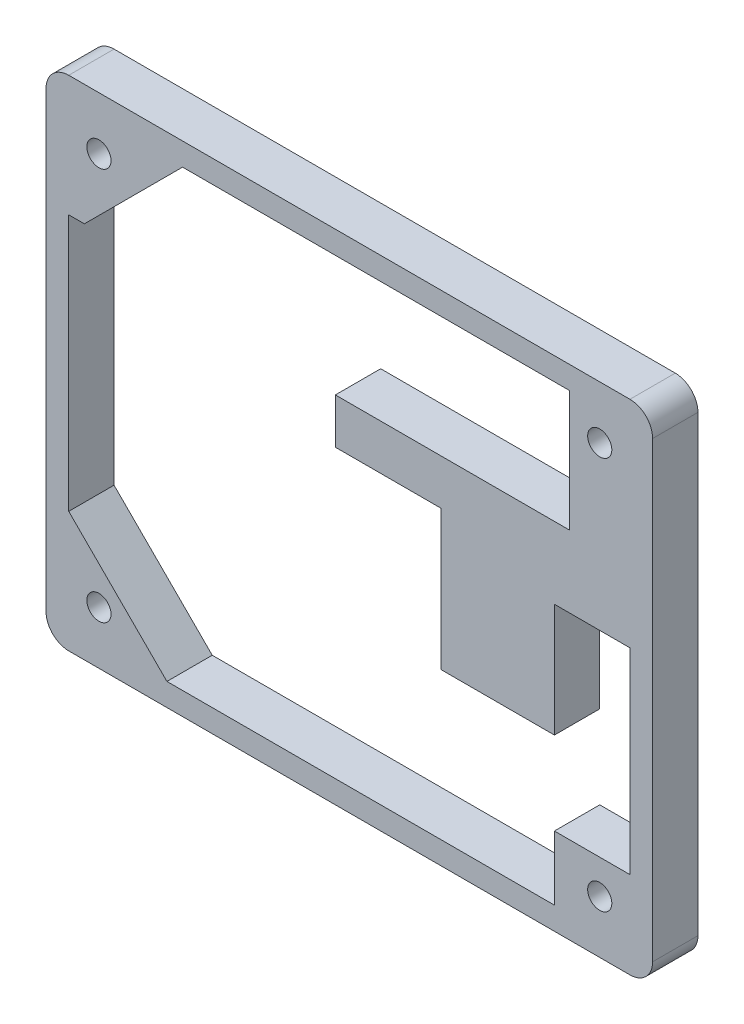
ISO-10303-21;
HEADER;
FILE_DESCRIPTION(('STEP AP214'),'2;1');
FILE_NAME('part.step','',(''),(''),'','','');
FILE_SCHEMA(('AUTOMOTIVE_DESIGN { 1 0 10303 214 1 1 1 1 }'));
ENDSEC;
DATA;
#1=APPLICATION_CONTEXT('core data for automotive mechanical design processes');
#2=APPLICATION_PROTOCOL_DEFINITION('international standard','automotive_design',2000,#1);
#3=PRODUCT_CONTEXT('',#1,'mechanical');
#4=PRODUCT('Part','Part','',(#3));
#5=PRODUCT_RELATED_PRODUCT_CATEGORY('part','',(#4));
#6=PRODUCT_DEFINITION_FORMATION('','',#4);
#7=PRODUCT_DEFINITION_CONTEXT('part definition',#1,'design');
#8=PRODUCT_DEFINITION('design','',#6,#7);
#9=PRODUCT_DEFINITION_SHAPE('','',#8);
#10=(LENGTH_UNIT() NAMED_UNIT(*) SI_UNIT(.MILLI.,.METRE.));
#11=(NAMED_UNIT(*) PLANE_ANGLE_UNIT() SI_UNIT($,.RADIAN.));
#12=(NAMED_UNIT(*) SI_UNIT($,.STERADIAN.) SOLID_ANGLE_UNIT());
#13=UNCERTAINTY_MEASURE_WITH_UNIT(LENGTH_MEASURE(1.E-05),#10,'distance_accuracy_value','');
#14=(GEOMETRIC_REPRESENTATION_CONTEXT(3) GLOBAL_UNCERTAINTY_ASSIGNED_CONTEXT((#13)) GLOBAL_UNIT_ASSIGNED_CONTEXT((#10,
#11,#12)) REPRESENTATION_CONTEXT('',''));
#15=CARTESIAN_POINT('',(0.,0.,0.));
#16=DIRECTION('',(0.,0.,1.));
#17=DIRECTION('',(1.,0.,0.));
#18=AXIS2_PLACEMENT_3D('',#15,#16,#17);
#19=CARTESIAN_POINT('',(0.,0.,6.));
#20=DIRECTION('',(1.,0.,0.));
#21=DIRECTION('',(0.,0.,-1.));
#22=AXIS2_PLACEMENT_3D('',#19,#20,#21);
#23=PLANE('',#22);
#24=DIRECTION('',(0.,-1.,0.));
#25=VECTOR('',#24,1.);
#26=CARTESIAN_POINT('',(0.,0.,0.));
#27=LINE('',#26,#25);
#28=CARTESIAN_POINT('',(0.,63.,0.));
#29=VERTEX_POINT('',#28);
#30=CARTESIAN_POINT('',(0.,3.,0.));
#31=VERTEX_POINT('',#30);
#32=EDGE_CURVE('E323',#29,#31,#27,.T.);
#33=ORIENTED_EDGE('',*,*,#32,.T.);
#34=DIRECTION('',(0.,0.,-1.));
#35=VECTOR('',#34,1.);
#36=CARTESIAN_POINT('',(0.,3.,6.));
#37=LINE('',#36,#35);
#38=CARTESIAN_POINT('',(0.,3.,6.));
#39=VERTEX_POINT('',#38);
#40=EDGE_CURVE('E11',#31,#39,#37,.F.);
#41=ORIENTED_EDGE('',*,*,#40,.T.);
#42=DIRECTION('',(0.,-1.,0.));
#43=VECTOR('',#42,1.);
#44=CARTESIAN_POINT('',(0.,0.,6.));
#45=LINE('',#44,#43);
#46=CARTESIAN_POINT('',(0.,63.,6.));
#47=VERTEX_POINT('',#46);
#48=EDGE_CURVE('E324',#47,#39,#45,.T.);
#49=ORIENTED_EDGE('',*,*,#48,.F.);
#50=DIRECTION('',(0.,0.,-1.));
#51=VECTOR('',#50,1.);
#52=CARTESIAN_POINT('',(0.,63.,6.));
#53=LINE('',#52,#51);
#54=EDGE_CURVE('E41',#47,#29,#53,.T.);
#55=ORIENTED_EDGE('',*,*,#54,.T.);
#56=EDGE_LOOP('',(#33,#41,#49,#55));
#57=FACE_BOUND('',#56,.T.);
#58=ADVANCED_FACE('F33',(#57),#23,.F.);
#59=CARTESIAN_POINT('',(0.,0.,6.));
#60=DIRECTION('',(0.,1.,0.));
#61=DIRECTION('',(0.,0.,1.));
#62=AXIS2_PLACEMENT_3D('',#59,#60,#61);
#63=PLANE('',#62);
#64=DIRECTION('',(1.,0.,0.));
#65=VECTOR('',#64,1.);
#66=CARTESIAN_POINT('',(0.,0.,0.));
#67=LINE('',#66,#65);
#68=CARTESIAN_POINT('',(3.,0.,0.));
#69=VERTEX_POINT('',#68);
#70=CARTESIAN_POINT('',(77.3,0.,0.));
#71=VERTEX_POINT('',#70);
#72=EDGE_CURVE('E340',#69,#71,#67,.T.);
#73=ORIENTED_EDGE('',*,*,#72,.T.);
#74=DIRECTION('',(0.,0.,-1.));
#75=VECTOR('',#74,1.);
#76=CARTESIAN_POINT('',(77.3,0.,6.));
#77=LINE('',#76,#75);
#78=CARTESIAN_POINT('',(77.3,0.,6.));
#79=VERTEX_POINT('',#78);
#80=EDGE_CURVE('E376',#71,#79,#77,.F.);
#81=ORIENTED_EDGE('',*,*,#80,.T.);
#82=DIRECTION('',(1.,0.,0.));
#83=VECTOR('',#82,1.);
#84=CARTESIAN_POINT('',(0.,0.,6.));
#85=LINE('',#84,#83);
#86=CARTESIAN_POINT('',(3.,0.,6.));
#87=VERTEX_POINT('',#86);
#88=EDGE_CURVE('E327',#87,#79,#85,.T.);
#89=ORIENTED_EDGE('',*,*,#88,.F.);
#90=DIRECTION('',(0.,0.,-1.));
#91=VECTOR('',#90,1.);
#92=CARTESIAN_POINT('',(3.,0.,6.));
#93=LINE('',#92,#91);
#94=EDGE_CURVE('E373',#87,#69,#93,.T.);
#95=ORIENTED_EDGE('',*,*,#94,.T.);
#96=EDGE_LOOP('',(#73,#81,#89,#95));
#97=FACE_BOUND('',#96,.T.);
#98=ADVANCED_FACE('F394',(#97),#63,.F.);
#99=CARTESIAN_POINT('',(80.3,0.,6.));
#100=DIRECTION('',(-1.,0.,0.));
#101=DIRECTION('',(0.,0.,1.));
#102=AXIS2_PLACEMENT_3D('',#99,#100,#101);
#103=PLANE('',#102);
#104=DIRECTION('',(0.,1.,0.));
#105=VECTOR('',#104,1.);
#106=CARTESIAN_POINT('',(80.3,0.,0.));
#107=LINE('',#106,#105);
#108=CARTESIAN_POINT('',(80.3,3.,0.));
#109=VERTEX_POINT('',#108);
#110=CARTESIAN_POINT('',(80.3,63.,0.));
#111=VERTEX_POINT('',#110);
#112=EDGE_CURVE('E343',#109,#111,#107,.T.);
#113=ORIENTED_EDGE('',*,*,#112,.T.);
#114=DIRECTION('',(0.,0.,-1.));
#115=VECTOR('',#114,1.);
#116=CARTESIAN_POINT('',(80.3,63.,6.));
#117=LINE('',#116,#115);
#118=CARTESIAN_POINT('',(80.3,63.,6.));
#119=VERTEX_POINT('',#118);
#120=EDGE_CURVE('E363',#111,#119,#117,.F.);
#121=ORIENTED_EDGE('',*,*,#120,.T.);
#122=DIRECTION('',(0.,1.,0.));
#123=VECTOR('',#122,1.);
#124=CARTESIAN_POINT('',(80.3,0.,6.));
#125=LINE('',#124,#123);
#126=CARTESIAN_POINT('',(80.3,3.,6.));
#127=VERTEX_POINT('',#126);
#128=EDGE_CURVE('E331',#127,#119,#125,.T.);
#129=ORIENTED_EDGE('',*,*,#128,.F.);
#130=DIRECTION('',(0.,0.,-1.));
#131=VECTOR('',#130,1.);
#132=CARTESIAN_POINT('',(80.3,3.,6.));
#133=LINE('',#132,#131);
#134=EDGE_CURVE('E360',#127,#109,#133,.T.);
#135=ORIENTED_EDGE('',*,*,#134,.T.);
#136=EDGE_LOOP('',(#113,#121,#129,#135));
#137=FACE_BOUND('',#136,.T.);
#138=ADVANCED_FACE('F405',(#137),#103,.F.);
#139=CARTESIAN_POINT('',(0.,66.,6.));
#140=DIRECTION('',(0.,-1.,0.));
#141=DIRECTION('',(0.,0.,-1.));
#142=AXIS2_PLACEMENT_3D('',#139,#140,#141);
#143=PLANE('',#142);
#144=DIRECTION('',(-1.,0.,0.));
#145=VECTOR('',#144,1.);
#146=CARTESIAN_POINT('',(0.,66.,6.));
#147=LINE('',#146,#145);
#148=CARTESIAN_POINT('',(77.3,66.,6.));
#149=VERTEX_POINT('',#148);
#150=CARTESIAN_POINT('',(3.,66.,6.));
#151=VERTEX_POINT('',#150);
#152=EDGE_CURVE('E334',#149,#151,#147,.T.);
#153=ORIENTED_EDGE('',*,*,#152,.F.);
#154=DIRECTION('',(0.,0.,-1.));
#155=VECTOR('',#154,1.);
#156=CARTESIAN_POINT('',(77.3,66.,6.));
#157=LINE('',#156,#155);
#158=CARTESIAN_POINT('',(77.3,66.,0.));
#159=VERTEX_POINT('',#158);
#160=EDGE_CURVE('E349',#149,#159,#157,.T.);
#161=ORIENTED_EDGE('',*,*,#160,.T.);
#162=DIRECTION('',(-1.,0.,0.));
#163=VECTOR('',#162,1.);
#164=CARTESIAN_POINT('',(0.,66.,0.));
#165=LINE('',#164,#163);
#166=CARTESIAN_POINT('',(3.,66.,0.));
#167=VERTEX_POINT('',#166);
#168=EDGE_CURVE('E328',#159,#167,#165,.T.);
#169=ORIENTED_EDGE('',*,*,#168,.T.);
#170=DIRECTION('',(0.,0.,-1.));
#171=VECTOR('',#170,1.);
#172=CARTESIAN_POINT('',(3.,66.,6.));
#173=LINE('',#172,#171);
#174=EDGE_CURVE('E337',#167,#151,#173,.F.);
#175=ORIENTED_EDGE('',*,*,#174,.T.);
#176=EDGE_LOOP('',(#153,#161,#169,#175));
#177=FACE_BOUND('',#176,.T.);
#178=ADVANCED_FACE('F413',(#177),#143,.F.);
#179=CARTESIAN_POINT('',(0.,0.,6.));
#180=DIRECTION('',(0.,0.,-1.));
#181=DIRECTION('',(-1.,0.,0.));
#182=AXIS2_PLACEMENT_3D('',#179,#180,#181);
#183=PLANE('',#182);
#184=DIRECTION('',(1.,0.,0.));
#185=VECTOR('',#184,1.);
#186=CARTESIAN_POINT('',(77.3,11.5,6.));
#187=LINE('',#186,#185);
#188=CARTESIAN_POINT('',(67.3,11.5,6.));
#189=VERTEX_POINT('',#188);
#190=CARTESIAN_POINT('',(77.3,11.5,6.));
#191=VERTEX_POINT('',#190);
#192=EDGE_CURVE('E240',#189,#191,#187,.T.);
#193=ORIENTED_EDGE('',*,*,#192,.F.);
#194=DIRECTION('',(0.,1.,0.));
#195=VECTOR('',#194,1.);
#196=CARTESIAN_POINT('',(67.3,11.5,6.));
#197=LINE('',#196,#195);
#198=CARTESIAN_POINT('',(67.3,3.,6.));
#199=VERTEX_POINT('',#198);
#200=EDGE_CURVE('E761',#199,#189,#197,.T.);
#201=ORIENTED_EDGE('',*,*,#200,.F.);
#202=DIRECTION('',(1.,0.,0.));
#203=VECTOR('',#202,1.);
#204=CARTESIAN_POINT('',(25.8293559072506,3.,6.));
#205=LINE('',#204,#203);
#206=CARTESIAN_POINT('',(16.0000000000002,2.99999999999999,6.));
#207=VERTEX_POINT('',#206);
#208=EDGE_CURVE('E766',#207,#199,#205,.T.);
#209=ORIENTED_EDGE('',*,*,#208,.F.);
#210=DIRECTION('',(0.707106781186552,-0.707106781186543,0.));
#211=VECTOR('',#210,1.);
#212=CARTESIAN_POINT('',(16.0000000000002,2.99999999999999,6.));
#213=LINE('',#212,#211);
#214=CARTESIAN_POINT('',(3.,16.,6.));
#215=VERTEX_POINT('',#214);
#216=EDGE_CURVE('E735',#215,#207,#213,.T.);
#217=ORIENTED_EDGE('',*,*,#216,.F.);
#218=DIRECTION('',(0.,-1.,0.));
#219=VECTOR('',#218,1.);
#220=CARTESIAN_POINT('',(3.,16.,6.));
#221=LINE('',#220,#219);
#222=CARTESIAN_POINT('',(3.,50.,6.));
#223=VERTEX_POINT('',#222);
#224=EDGE_CURVE('E279',#223,#215,#221,.T.);
#225=ORIENTED_EDGE('',*,*,#224,.F.);
#226=DIRECTION('',(-1.,0.,0.));
#227=VECTOR('',#226,1.);
#228=CARTESIAN_POINT('',(3.,50.,6.));
#229=LINE('',#228,#227);
#230=CARTESIAN_POINT('',(5.07106781186543,50.,6.));
#231=VERTEX_POINT('',#230);
#232=EDGE_CURVE('E289',#231,#223,#229,.T.);
#233=ORIENTED_EDGE('',*,*,#232,.F.);
#234=DIRECTION('',(-0.707106781186551,-0.707106781186544,0.));
#235=VECTOR('',#234,1.);
#236=CARTESIAN_POINT('',(5.07106781186543,50.,6.));
#237=LINE('',#236,#235);
#238=CARTESIAN_POINT('',(18.0710678118656,63.,6.));
#239=VERTEX_POINT('',#238);
#240=EDGE_CURVE('E726',#239,#231,#237,.T.);
#241=ORIENTED_EDGE('',*,*,#240,.F.);
#242=DIRECTION('',(-1.,0.,0.));
#243=VECTOR('',#242,1.);
#244=CARTESIAN_POINT('',(69.3,63.,6.));
#245=LINE('',#244,#243);
#246=CARTESIAN_POINT('',(69.3,63.,6.));
#247=VERTEX_POINT('',#246);
#248=EDGE_CURVE('E273',#247,#239,#245,.T.);
#249=ORIENTED_EDGE('',*,*,#248,.F.);
#250=DIRECTION('',(0.,1.,0.));
#251=VECTOR('',#250,1.);
#252=CARTESIAN_POINT('',(69.3,63.,6.));
#253=LINE('',#252,#251);
#254=CARTESIAN_POINT('',(69.3,47.,6.));
#255=VERTEX_POINT('',#254);
#256=EDGE_CURVE('E261',#255,#247,#253,.T.);
#257=ORIENTED_EDGE('',*,*,#256,.F.);
#258=DIRECTION('',(1.,0.,0.));
#259=VECTOR('',#258,1.);
#260=CARTESIAN_POINT('',(69.3,47.,6.));
#261=LINE('',#260,#259);
#262=CARTESIAN_POINT('',(38.3,47.,6.));
#263=VERTEX_POINT('',#262);
#264=EDGE_CURVE('E266',#263,#255,#261,.T.);
#265=ORIENTED_EDGE('',*,*,#264,.F.);
#266=DIRECTION('',(0.,1.,0.));
#267=VECTOR('',#266,1.);
#268=CARTESIAN_POINT('',(38.3,47.,6.));
#269=LINE('',#268,#267);
#270=CARTESIAN_POINT('',(38.3,41.,6.));
#271=VERTEX_POINT('',#270);
#272=EDGE_CURVE('E736',#271,#263,#269,.T.);
#273=ORIENTED_EDGE('',*,*,#272,.F.);
#274=DIRECTION('',(-1.,0.,0.));
#275=VECTOR('',#274,1.);
#276=CARTESIAN_POINT('',(52.3,41.,6.));
#277=LINE('',#276,#275);
#278=CARTESIAN_POINT('',(52.3,41.,6.));
#279=VERTEX_POINT('',#278);
#280=EDGE_CURVE('E254',#279,#271,#277,.T.);
#281=ORIENTED_EDGE('',*,*,#280,.F.);
#282=DIRECTION('',(0.,1.,0.));
#283=VECTOR('',#282,1.);
#284=CARTESIAN_POINT('',(52.3,41.,6.));
#285=LINE('',#284,#283);
#286=CARTESIAN_POINT('',(52.3,22.5,6.));
#287=VERTEX_POINT('',#286);
#288=EDGE_CURVE('E245',#287,#279,#285,.T.);
#289=ORIENTED_EDGE('',*,*,#288,.F.);
#290=DIRECTION('',(-1.,0.,0.));
#291=VECTOR('',#290,1.);
#292=CARTESIAN_POINT('',(25.8293559072506,22.5,6.));
#293=LINE('',#292,#291);
#294=CARTESIAN_POINT('',(67.3,22.5,6.));
#295=VERTEX_POINT('',#294);
#296=EDGE_CURVE('E774',#295,#287,#293,.T.);
#297=ORIENTED_EDGE('',*,*,#296,.F.);
#298=DIRECTION('',(0.,-1.,0.));
#299=VECTOR('',#298,1.);
#300=CARTESIAN_POINT('',(67.3,37.5,6.));
#301=LINE('',#300,#299);
#302=CARTESIAN_POINT('',(67.3,37.5,6.));
#303=VERTEX_POINT('',#302);
#304=EDGE_CURVE('E216',#303,#295,#301,.T.);
#305=ORIENTED_EDGE('',*,*,#304,.F.);
#306=DIRECTION('',(-1.,0.,0.));
#307=VECTOR('',#306,1.);
#308=CARTESIAN_POINT('',(77.3,37.5,6.));
#309=LINE('',#308,#307);
#310=CARTESIAN_POINT('',(77.3,37.5,6.));
#311=VERTEX_POINT('',#310);
#312=EDGE_CURVE('E236',#311,#303,#309,.T.);
#313=ORIENTED_EDGE('',*,*,#312,.F.);
#314=DIRECTION('',(0.,1.,0.));
#315=VECTOR('',#314,1.);
#316=CARTESIAN_POINT('',(77.3,37.5,6.));
#317=LINE('',#316,#315);
#318=EDGE_CURVE('E56',#191,#311,#317,.T.);
#319=ORIENTED_EDGE('',*,*,#318,.F.);
#320=EDGE_LOOP('',(#193,#201,#209,#217,#225,#233,#241,#249,#257,#265,#273,#281,#289,#297,#305,
#313,#319));
#321=FACE_BOUND('',#320,.T.);
#322=CARTESIAN_POINT('',(7.,59.,6.));
#323=DIRECTION('',(0.,0.,1.));
#324=DIRECTION('',(1.,0.,0.));
#325=AXIS2_PLACEMENT_3D('',#322,#323,#324);
#326=CIRCLE('',#325,1.59999999999999);
#327=CARTESIAN_POINT('',(8.59999999999999,59.,6.));
#328=VERTEX_POINT('',#327);
#329=EDGE_CURVE('E298',#328,#328,#326,.T.);
#330=ORIENTED_EDGE('',*,*,#329,.F.);
#331=EDGE_LOOP('',(#330));
#332=FACE_BOUND('',#331,.T.);
#333=CARTESIAN_POINT('',(73.3,59.,6.));
#334=DIRECTION('',(0.,0.,1.));
#335=DIRECTION('',(1.,0.,0.));
#336=AXIS2_PLACEMENT_3D('',#333,#334,#335);
#337=CIRCLE('',#336,1.59999999999999);
#338=CARTESIAN_POINT('',(74.9,59.,6.));
#339=VERTEX_POINT('',#338);
#340=EDGE_CURVE('E305',#339,#339,#337,.T.);
#341=ORIENTED_EDGE('',*,*,#340,.F.);
#342=EDGE_LOOP('',(#341));
#343=FACE_BOUND('',#342,.T.);
#344=CARTESIAN_POINT('',(73.3,7.,6.));
#345=DIRECTION('',(0.,0.,1.));
#346=DIRECTION('',(1.,0.,0.));
#347=AXIS2_PLACEMENT_3D('',#344,#345,#346);
#348=CIRCLE('',#347,1.59999999999999);
#349=CARTESIAN_POINT('',(74.9,7.,6.));
#350=VERTEX_POINT('',#349);
#351=EDGE_CURVE('E311',#350,#350,#348,.T.);
#352=ORIENTED_EDGE('',*,*,#351,.F.);
#353=EDGE_LOOP('',(#352));
#354=FACE_BOUND('',#353,.T.);
#355=CARTESIAN_POINT('',(7.00000000000001,7.,6.));
#356=DIRECTION('',(0.,0.,1.));
#357=DIRECTION('',(1.,0.,0.));
#358=AXIS2_PLACEMENT_3D('',#355,#356,#357);
#359=CIRCLE('',#358,1.59999999999999);
#360=CARTESIAN_POINT('',(8.59999999999999,7.,6.));
#361=VERTEX_POINT('',#360);
#362=EDGE_CURVE('E317',#361,#361,#359,.T.);
#363=ORIENTED_EDGE('',*,*,#362,.F.);
#364=EDGE_LOOP('',(#363));
#365=FACE_BOUND('',#364,.T.);
#366=ORIENTED_EDGE('',*,*,#128,.T.);
#367=CARTESIAN_POINT('',(77.3,63.,6.));
#368=DIRECTION('',(0.,0.,-1.));
#369=DIRECTION('',(-1.,0.,0.));
#370=AXIS2_PLACEMENT_3D('',#367,#368,#369);
#371=CIRCLE('',#370,3.);
#372=EDGE_CURVE('E371',#119,#149,#371,.F.);
#373=ORIENTED_EDGE('',*,*,#372,.T.);
#374=ORIENTED_EDGE('',*,*,#152,.T.);
#375=CARTESIAN_POINT('',(3.,63.,6.));
#376=DIRECTION('',(0.,0.,-1.));
#377=DIRECTION('',(-1.,0.,0.));
#378=AXIS2_PLACEMENT_3D('',#375,#376,#377);
#379=CIRCLE('',#378,3.);
#380=EDGE_CURVE('E365',#151,#47,#379,.F.);
#381=ORIENTED_EDGE('',*,*,#380,.T.);
#382=ORIENTED_EDGE('',*,*,#48,.T.);
#383=CARTESIAN_POINT('',(3.,3.,6.));
#384=DIRECTION('',(0.,0.,-1.));
#385=DIRECTION('',(-1.,0.,0.));
#386=AXIS2_PLACEMENT_3D('',#383,#384,#385);
#387=CIRCLE('',#386,3.);
#388=EDGE_CURVE('E367',#39,#87,#387,.F.);
#389=ORIENTED_EDGE('',*,*,#388,.T.);
#390=ORIENTED_EDGE('',*,*,#88,.T.);
#391=CARTESIAN_POINT('',(77.3,3.,6.));
#392=DIRECTION('',(0.,0.,-1.));
#393=DIRECTION('',(-1.,0.,0.));
#394=AXIS2_PLACEMENT_3D('',#391,#392,#393);
#395=CIRCLE('',#394,3.);
#396=EDGE_CURVE('E369',#79,#127,#395,.F.);
#397=ORIENTED_EDGE('',*,*,#396,.T.);
#398=EDGE_LOOP('',(#366,#373,#374,#381,#382,#389,#390,#397));
#399=FACE_BOUND('',#398,.T.);
#400=ADVANCED_FACE('F398',(#321,#332,#343,#354,#365,#399),#183,.F.);
#401=CARTESIAN_POINT('',(0.,0.,0.));
#402=DIRECTION('',(0.,0.,-1.));
#403=DIRECTION('',(-1.,0.,0.));
#404=AXIS2_PLACEMENT_3D('',#401,#402,#403);
#405=PLANE('',#404);
#406=DIRECTION('',(0.,1.,0.));
#407=VECTOR('',#406,1.);
#408=CARTESIAN_POINT('',(67.3,22.5,0.));
#409=LINE('',#408,#407);
#410=CARTESIAN_POINT('',(67.3,3.,0.));
#411=VERTEX_POINT('',#410);
#412=CARTESIAN_POINT('',(67.3,11.5,0.));
#413=VERTEX_POINT('',#412);
#414=EDGE_CURVE('E755',#411,#413,#409,.T.);
#415=ORIENTED_EDGE('',*,*,#414,.T.);
#416=DIRECTION('',(1.,0.,0.));
#417=VECTOR('',#416,1.);
#418=CARTESIAN_POINT('',(77.3,11.5,0.));
#419=LINE('',#418,#417);
#420=CARTESIAN_POINT('',(77.3,11.5,0.));
#421=VERTEX_POINT('',#420);
#422=EDGE_CURVE('E226',#413,#421,#419,.T.);
#423=ORIENTED_EDGE('',*,*,#422,.T.);
#424=DIRECTION('',(0.,1.,0.));
#425=VECTOR('',#424,1.);
#426=CARTESIAN_POINT('',(77.3,37.5,0.));
#427=LINE('',#426,#425);
#428=CARTESIAN_POINT('',(77.3,37.5,0.));
#429=VERTEX_POINT('',#428);
#430=EDGE_CURVE('E231',#421,#429,#427,.T.);
#431=ORIENTED_EDGE('',*,*,#430,.T.);
#432=DIRECTION('',(-1.,0.,0.));
#433=VECTOR('',#432,1.);
#434=CARTESIAN_POINT('',(77.3,37.5,0.));
#435=LINE('',#434,#433);
#436=CARTESIAN_POINT('',(67.3,37.5,0.));
#437=VERTEX_POINT('',#436);
#438=EDGE_CURVE('E225',#429,#437,#435,.T.);
#439=ORIENTED_EDGE('',*,*,#438,.T.);
#440=DIRECTION('',(0.,-1.,0.));
#441=VECTOR('',#440,1.);
#442=CARTESIAN_POINT('',(67.3,37.5,0.));
#443=LINE('',#442,#441);
#444=CARTESIAN_POINT('',(67.3,22.5,0.));
#445=VERTEX_POINT('',#444);
#446=EDGE_CURVE('E213',#437,#445,#443,.T.);
#447=ORIENTED_EDGE('',*,*,#446,.T.);
#448=DIRECTION('',(-1.,0.,0.));
#449=VECTOR('',#448,1.);
#450=CARTESIAN_POINT('',(25.8293559072506,22.5,0.));
#451=LINE('',#450,#449);
#452=CARTESIAN_POINT('',(52.3,22.5,0.));
#453=VERTEX_POINT('',#452);
#454=EDGE_CURVE('E200',#445,#453,#451,.T.);
#455=ORIENTED_EDGE('',*,*,#454,.T.);
#456=DIRECTION('',(0.,1.,0.));
#457=VECTOR('',#456,1.);
#458=CARTESIAN_POINT('',(52.3,41.,0.));
#459=LINE('',#458,#457);
#460=CARTESIAN_POINT('',(52.3,41.,0.));
#461=VERTEX_POINT('',#460);
#462=EDGE_CURVE('E48',#453,#461,#459,.T.);
#463=ORIENTED_EDGE('',*,*,#462,.T.);
#464=DIRECTION('',(-1.,0.,0.));
#465=VECTOR('',#464,1.);
#466=CARTESIAN_POINT('',(52.3,41.,0.));
#467=LINE('',#466,#465);
#468=CARTESIAN_POINT('',(38.3,41.,0.));
#469=VERTEX_POINT('',#468);
#470=EDGE_CURVE('E253',#461,#469,#467,.T.);
#471=ORIENTED_EDGE('',*,*,#470,.T.);
#472=DIRECTION('',(0.,1.,0.));
#473=VECTOR('',#472,1.);
#474=CARTESIAN_POINT('',(38.3,47.,0.));
#475=LINE('',#474,#473);
#476=CARTESIAN_POINT('',(38.3,47.,0.));
#477=VERTEX_POINT('',#476);
#478=EDGE_CURVE('E751',#469,#477,#475,.T.);
#479=ORIENTED_EDGE('',*,*,#478,.T.);
#480=DIRECTION('',(1.,0.,0.));
#481=VECTOR('',#480,1.);
#482=CARTESIAN_POINT('',(69.3,47.,0.));
#483=LINE('',#482,#481);
#484=CARTESIAN_POINT('',(69.3,47.,0.));
#485=VERTEX_POINT('',#484);
#486=EDGE_CURVE('E268',#477,#485,#483,.T.);
#487=ORIENTED_EDGE('',*,*,#486,.T.);
#488=DIRECTION('',(0.,1.,0.));
#489=VECTOR('',#488,1.);
#490=CARTESIAN_POINT('',(69.3,63.,0.));
#491=LINE('',#490,#489);
#492=CARTESIAN_POINT('',(69.3,63.,0.));
#493=VERTEX_POINT('',#492);
#494=EDGE_CURVE('E262',#485,#493,#491,.T.);
#495=ORIENTED_EDGE('',*,*,#494,.T.);
#496=DIRECTION('',(-1.,0.,0.));
#497=VECTOR('',#496,1.);
#498=CARTESIAN_POINT('',(69.3,63.,0.));
#499=LINE('',#498,#497);
#500=CARTESIAN_POINT('',(18.0710678118656,63.,0.));
#501=VERTEX_POINT('',#500);
#502=EDGE_CURVE('E265',#493,#501,#499,.T.);
#503=ORIENTED_EDGE('',*,*,#502,.T.);
#504=DIRECTION('',(-0.707106781186551,-0.707106781186544,0.));
#505=VECTOR('',#504,1.);
#506=CARTESIAN_POINT('',(5.07106781186543,50.,0.));
#507=LINE('',#506,#505);
#508=CARTESIAN_POINT('',(5.07106781186543,50.,0.));
#509=VERTEX_POINT('',#508);
#510=EDGE_CURVE('E749',#501,#509,#507,.T.);
#511=ORIENTED_EDGE('',*,*,#510,.T.);
#512=DIRECTION('',(-1.,0.,0.));
#513=VECTOR('',#512,1.);
#514=CARTESIAN_POINT('',(3.,50.,0.));
#515=LINE('',#514,#513);
#516=CARTESIAN_POINT('',(3.,50.,0.));
#517=VERTEX_POINT('',#516);
#518=EDGE_CURVE('E288',#509,#517,#515,.T.);
#519=ORIENTED_EDGE('',*,*,#518,.T.);
#520=DIRECTION('',(0.,-1.,0.));
#521=VECTOR('',#520,1.);
#522=CARTESIAN_POINT('',(3.,16.,0.));
#523=LINE('',#522,#521);
#524=CARTESIAN_POINT('',(3.,16.,0.));
#525=VERTEX_POINT('',#524);
#526=EDGE_CURVE('E285',#517,#525,#523,.T.);
#527=ORIENTED_EDGE('',*,*,#526,.T.);
#528=DIRECTION('',(0.707106781186552,-0.707106781186543,0.));
#529=VECTOR('',#528,1.);
#530=CARTESIAN_POINT('',(16.0000000000002,2.99999999999999,0.));
#531=LINE('',#530,#529);
#532=CARTESIAN_POINT('',(16.0000000000002,2.99999999999999,0.));
#533=VERTEX_POINT('',#532);
#534=EDGE_CURVE('E217',#525,#533,#531,.T.);
#535=ORIENTED_EDGE('',*,*,#534,.T.);
#536=DIRECTION('',(1.,0.,0.));
#537=VECTOR('',#536,1.);
#538=CARTESIAN_POINT('',(25.8293559072506,3.,0.));
#539=LINE('',#538,#537);
#540=EDGE_CURVE('E209',#533,#411,#539,.T.);
#541=ORIENTED_EDGE('',*,*,#540,.T.);
#542=EDGE_LOOP('',(#415,#423,#431,#439,#447,#455,#463,#471,#479,#487,#495,#503,#511,#519,#527,
#535,#541));
#543=FACE_BOUND('',#542,.T.);
#544=CARTESIAN_POINT('',(7.,59.,0.));
#545=DIRECTION('',(0.,0.,1.));
#546=DIRECTION('',(1.,0.,0.));
#547=AXIS2_PLACEMENT_3D('',#544,#545,#546);
#548=CIRCLE('',#547,1.6);
#549=CARTESIAN_POINT('',(8.6,59.,0.));
#550=VERTEX_POINT('',#549);
#551=EDGE_CURVE('E302',#550,#550,#548,.T.);
#552=ORIENTED_EDGE('',*,*,#551,.T.);
#553=EDGE_LOOP('',(#552));
#554=FACE_BOUND('',#553,.T.);
#555=CARTESIAN_POINT('',(73.3,59.,0.));
#556=DIRECTION('',(0.,0.,1.));
#557=DIRECTION('',(1.,0.,0.));
#558=AXIS2_PLACEMENT_3D('',#555,#556,#557);
#559=CIRCLE('',#558,1.6);
#560=CARTESIAN_POINT('',(74.9,59.,0.));
#561=VERTEX_POINT('',#560);
#562=EDGE_CURVE('E308',#561,#561,#559,.T.);
#563=ORIENTED_EDGE('',*,*,#562,.T.);
#564=EDGE_LOOP('',(#563));
#565=FACE_BOUND('',#564,.T.);
#566=CARTESIAN_POINT('',(73.3,7.,0.));
#567=DIRECTION('',(0.,0.,1.));
#568=DIRECTION('',(1.,0.,0.));
#569=AXIS2_PLACEMENT_3D('',#566,#567,#568);
#570=CIRCLE('',#569,1.6);
#571=CARTESIAN_POINT('',(74.9,7.,0.));
#572=VERTEX_POINT('',#571);
#573=EDGE_CURVE('E314',#572,#572,#570,.T.);
#574=ORIENTED_EDGE('',*,*,#573,.T.);
#575=EDGE_LOOP('',(#574));
#576=FACE_BOUND('',#575,.T.);
#577=CARTESIAN_POINT('',(7.00000000000001,7.,0.));
#578=DIRECTION('',(0.,0.,1.));
#579=DIRECTION('',(1.,0.,0.));
#580=AXIS2_PLACEMENT_3D('',#577,#578,#579);
#581=CIRCLE('',#580,1.6);
#582=CARTESIAN_POINT('',(8.6,7.,0.));
#583=VERTEX_POINT('',#582);
#584=EDGE_CURVE('E320',#583,#583,#581,.T.);
#585=ORIENTED_EDGE('',*,*,#584,.T.);
#586=EDGE_LOOP('',(#585));
#587=FACE_BOUND('',#586,.T.);
#588=ORIENTED_EDGE('',*,*,#168,.F.);
#589=CARTESIAN_POINT('',(77.3,63.,0.));
#590=DIRECTION('',(0.,0.,-1.));
#591=DIRECTION('',(-1.,0.,0.));
#592=AXIS2_PLACEMENT_3D('',#589,#590,#591);
#593=CIRCLE('',#592,3.);
#594=EDGE_CURVE('E358',#159,#111,#593,.T.);
#595=ORIENTED_EDGE('',*,*,#594,.T.);
#596=ORIENTED_EDGE('',*,*,#112,.F.);
#597=CARTESIAN_POINT('',(77.3,3.,0.));
#598=DIRECTION('',(0.,0.,-1.));
#599=DIRECTION('',(-1.,0.,0.));
#600=AXIS2_PLACEMENT_3D('',#597,#598,#599);
#601=CIRCLE('',#600,3.);
#602=EDGE_CURVE('E356',#109,#71,#601,.T.);
#603=ORIENTED_EDGE('',*,*,#602,.T.);
#604=ORIENTED_EDGE('',*,*,#72,.F.);
#605=CARTESIAN_POINT('',(3.,3.,0.));
#606=DIRECTION('',(0.,0.,-1.));
#607=DIRECTION('',(-1.,0.,0.));
#608=AXIS2_PLACEMENT_3D('',#605,#606,#607);
#609=CIRCLE('',#608,3.);
#610=EDGE_CURVE('E354',#69,#31,#609,.T.);
#611=ORIENTED_EDGE('',*,*,#610,.T.);
#612=ORIENTED_EDGE('',*,*,#32,.F.);
#613=CARTESIAN_POINT('',(3.,63.,0.));
#614=DIRECTION('',(0.,0.,-1.));
#615=DIRECTION('',(-1.,0.,0.));
#616=AXIS2_PLACEMENT_3D('',#613,#614,#615);
#617=CIRCLE('',#616,3.);
#618=EDGE_CURVE('E352',#29,#167,#617,.T.);
#619=ORIENTED_EDGE('',*,*,#618,.T.);
#620=EDGE_LOOP('',(#588,#595,#596,#603,#604,#611,#612,#619));
#621=FACE_BOUND('',#620,.T.);
#622=ADVANCED_FACE('F221',(#543,#554,#565,#576,#587,#621),#405,.T.);
#623=CARTESIAN_POINT('',(7.00000000000001,7.,6.));
#624=DIRECTION('',(0.,0.,1.));
#625=DIRECTION('',(1.,0.,0.));
#626=AXIS2_PLACEMENT_3D('',#623,#624,#625);
#627=CYLINDRICAL_SURFACE('',#626,1.59999999999999);
#628=ORIENTED_EDGE('',*,*,#584,.F.);
#629=EDGE_LOOP('',(#628));
#630=FACE_BOUND('',#629,.T.);
#631=ORIENTED_EDGE('',*,*,#362,.T.);
#632=EDGE_LOOP('',(#631));
#633=FACE_BOUND('',#632,.T.);
#634=ADVANCED_FACE('F514',(#630,#633),#627,.F.);
#635=CARTESIAN_POINT('',(73.3,7.,6.));
#636=DIRECTION('',(0.,0.,1.));
#637=DIRECTION('',(1.,0.,0.));
#638=AXIS2_PLACEMENT_3D('',#635,#636,#637);
#639=CYLINDRICAL_SURFACE('',#638,1.6);
#640=ORIENTED_EDGE('',*,*,#573,.F.);
#641=EDGE_LOOP('',(#640));
#642=FACE_BOUND('',#641,.T.);
#643=ORIENTED_EDGE('',*,*,#351,.T.);
#644=EDGE_LOOP('',(#643));
#645=FACE_BOUND('',#644,.T.);
#646=ADVANCED_FACE('F647',(#642,#645),#639,.F.);
#647=CARTESIAN_POINT('',(73.3,59.,6.));
#648=DIRECTION('',(0.,0.,1.));
#649=DIRECTION('',(1.,0.,0.));
#650=AXIS2_PLACEMENT_3D('',#647,#648,#649);
#651=CYLINDRICAL_SURFACE('',#650,1.6);
#652=ORIENTED_EDGE('',*,*,#562,.F.);
#653=EDGE_LOOP('',(#652));
#654=FACE_BOUND('',#653,.T.);
#655=ORIENTED_EDGE('',*,*,#340,.T.);
#656=EDGE_LOOP('',(#655));
#657=FACE_BOUND('',#656,.T.);
#658=ADVANCED_FACE('F643',(#654,#657),#651,.F.);
#659=CARTESIAN_POINT('',(7.,59.,6.));
#660=DIRECTION('',(0.,0.,1.));
#661=DIRECTION('',(1.,0.,0.));
#662=AXIS2_PLACEMENT_3D('',#659,#660,#661);
#663=CYLINDRICAL_SURFACE('',#662,1.59999999999999);
#664=ORIENTED_EDGE('',*,*,#551,.F.);
#665=EDGE_LOOP('',(#664));
#666=FACE_BOUND('',#665,.T.);
#667=ORIENTED_EDGE('',*,*,#329,.T.);
#668=EDGE_LOOP('',(#667));
#669=FACE_BOUND('',#668,.T.);
#670=ADVANCED_FACE('F434',(#666,#669),#663,.F.);
#671=CARTESIAN_POINT('',(77.3,63.,6.));
#672=DIRECTION('',(0.,0.,-1.));
#673=DIRECTION('',(-1.,0.,0.));
#674=AXIS2_PLACEMENT_3D('',#671,#672,#673);
#675=CYLINDRICAL_SURFACE('',#674,3.);
#676=ORIENTED_EDGE('',*,*,#372,.F.);
#677=ORIENTED_EDGE('',*,*,#120,.F.);
#678=ORIENTED_EDGE('',*,*,#594,.F.);
#679=ORIENTED_EDGE('',*,*,#160,.F.);
#680=EDGE_LOOP('',(#676,#677,#678,#679));
#681=FACE_BOUND('',#680,.T.);
#682=ADVANCED_FACE('F410',(#681),#675,.T.);
#683=CARTESIAN_POINT('',(77.3,3.,6.));
#684=DIRECTION('',(0.,0.,-1.));
#685=DIRECTION('',(-1.,0.,0.));
#686=AXIS2_PLACEMENT_3D('',#683,#684,#685);
#687=CYLINDRICAL_SURFACE('',#686,3.);
#688=ORIENTED_EDGE('',*,*,#396,.F.);
#689=ORIENTED_EDGE('',*,*,#80,.F.);
#690=ORIENTED_EDGE('',*,*,#602,.F.);
#691=ORIENTED_EDGE('',*,*,#134,.F.);
#692=EDGE_LOOP('',(#688,#689,#690,#691));
#693=FACE_BOUND('',#692,.T.);
#694=ADVANCED_FACE('F402',(#693),#687,.T.);
#695=CARTESIAN_POINT('',(3.,3.,6.));
#696=DIRECTION('',(0.,0.,-1.));
#697=DIRECTION('',(-1.,0.,0.));
#698=AXIS2_PLACEMENT_3D('',#695,#696,#697);
#699=CYLINDRICAL_SURFACE('',#698,3.);
#700=ORIENTED_EDGE('',*,*,#388,.F.);
#701=ORIENTED_EDGE('',*,*,#40,.F.);
#702=ORIENTED_EDGE('',*,*,#610,.F.);
#703=ORIENTED_EDGE('',*,*,#94,.F.);
#704=EDGE_LOOP('',(#700,#701,#702,#703));
#705=FACE_BOUND('',#704,.T.);
#706=ADVANCED_FACE('F391',(#705),#699,.T.);
#707=CARTESIAN_POINT('',(3.,63.,6.));
#708=DIRECTION('',(0.,0.,-1.));
#709=DIRECTION('',(-1.,0.,0.));
#710=AXIS2_PLACEMENT_3D('',#707,#708,#709);
#711=CYLINDRICAL_SURFACE('',#710,3.);
#712=ORIENTED_EDGE('',*,*,#380,.F.);
#713=ORIENTED_EDGE('',*,*,#174,.F.);
#714=ORIENTED_EDGE('',*,*,#618,.F.);
#715=ORIENTED_EDGE('',*,*,#54,.F.);
#716=EDGE_LOOP('',(#712,#713,#714,#715));
#717=FACE_BOUND('',#716,.T.);
#718=ADVANCED_FACE('F35',(#717),#711,.T.);
#719=CARTESIAN_POINT('',(3.,16.,0.));
#720=DIRECTION('',(-1.,0.,0.));
#721=DIRECTION('',(0.,0.,1.));
#722=AXIS2_PLACEMENT_3D('',#719,#720,#721);
#723=PLANE('',#722);
#724=ORIENTED_EDGE('',*,*,#224,.T.);
#725=DIRECTION('',(0.,0.,1.));
#726=VECTOR('',#725,1.);
#727=CARTESIAN_POINT('',(3.,16.,0.));
#728=LINE('',#727,#726);
#729=EDGE_CURVE('E291',#525,#215,#728,.T.);
#730=ORIENTED_EDGE('',*,*,#729,.F.);
#731=ORIENTED_EDGE('',*,*,#526,.F.);
#732=DIRECTION('',(0.,0.,1.));
#733=VECTOR('',#732,1.);
#734=CARTESIAN_POINT('',(3.,50.,0.));
#735=LINE('',#734,#733);
#736=EDGE_CURVE('E295',#517,#223,#735,.T.);
#737=ORIENTED_EDGE('',*,*,#736,.T.);
#738=EDGE_LOOP('',(#724,#730,#731,#737));
#739=FACE_BOUND('',#738,.T.);
#740=ADVANCED_FACE('F416',(#739),#723,.F.);
#741=CARTESIAN_POINT('',(3.,50.,0.));
#742=DIRECTION('',(0.,1.,0.));
#743=DIRECTION('',(0.,0.,1.));
#744=AXIS2_PLACEMENT_3D('',#741,#742,#743);
#745=PLANE('',#744);
#746=ORIENTED_EDGE('',*,*,#518,.F.);
#747=DIRECTION('',(0.,0.,1.));
#748=VECTOR('',#747,1.);
#749=CARTESIAN_POINT('',(5.07106781186543,50.,0.));
#750=LINE('',#749,#748);
#751=EDGE_CURVE('E729',#509,#231,#750,.T.);
#752=ORIENTED_EDGE('',*,*,#751,.T.);
#753=ORIENTED_EDGE('',*,*,#232,.T.);
#754=ORIENTED_EDGE('',*,*,#736,.F.);
#755=EDGE_LOOP('',(#746,#752,#753,#754));
#756=FACE_BOUND('',#755,.T.);
#757=ADVANCED_FACE('F421',(#756),#745,.F.);
#758=CARTESIAN_POINT('',(69.3,63.,0.));
#759=DIRECTION('',(1.,0.,0.));
#760=DIRECTION('',(0.,1.,0.));
#761=AXIS2_PLACEMENT_3D('',#758,#759,#760);
#762=PLANE('',#761);
#763=ORIENTED_EDGE('',*,*,#256,.T.);
#764=DIRECTION('',(0.,0.,1.));
#765=VECTOR('',#764,1.);
#766=CARTESIAN_POINT('',(69.3,63.,0.));
#767=LINE('',#766,#765);
#768=EDGE_CURVE('E271',#493,#247,#767,.T.);
#769=ORIENTED_EDGE('',*,*,#768,.F.);
#770=ORIENTED_EDGE('',*,*,#494,.F.);
#771=DIRECTION('',(0.,0.,1.));
#772=VECTOR('',#771,1.);
#773=CARTESIAN_POINT('',(69.3,47.,0.));
#774=LINE('',#773,#772);
#775=EDGE_CURVE('E277',#485,#255,#774,.T.);
#776=ORIENTED_EDGE('',*,*,#775,.T.);
#777=EDGE_LOOP('',(#763,#769,#770,#776));
#778=FACE_BOUND('',#777,.T.);
#779=ADVANCED_FACE('F455',(#778),#762,.F.);
#780=CARTESIAN_POINT('',(69.3,47.,0.));
#781=DIRECTION('',(0.,-1.,0.));
#782=DIRECTION('',(1.,0.,0.));
#783=AXIS2_PLACEMENT_3D('',#780,#781,#782);
#784=PLANE('',#783);
#785=ORIENTED_EDGE('',*,*,#264,.T.);
#786=ORIENTED_EDGE('',*,*,#775,.F.);
#787=ORIENTED_EDGE('',*,*,#486,.F.);
#788=DIRECTION('',(0.,0.,1.));
#789=VECTOR('',#788,1.);
#790=CARTESIAN_POINT('',(38.3,47.,0.));
#791=LINE('',#790,#789);
#792=EDGE_CURVE('E280',#477,#263,#791,.T.);
#793=ORIENTED_EDGE('',*,*,#792,.T.);
#794=EDGE_LOOP('',(#785,#786,#787,#793));
#795=FACE_BOUND('',#794,.T.);
#796=ADVANCED_FACE('F460',(#795),#784,.F.);
#797=CARTESIAN_POINT('',(69.3,63.,0.));
#798=DIRECTION('',(0.,1.,0.));
#799=DIRECTION('',(0.,0.,1.));
#800=AXIS2_PLACEMENT_3D('',#797,#798,#799);
#801=PLANE('',#800);
#802=ORIENTED_EDGE('',*,*,#248,.T.);
#803=DIRECTION('',(0.,0.,1.));
#804=VECTOR('',#803,1.);
#805=CARTESIAN_POINT('',(18.0710678118656,63.,0.));
#806=LINE('',#805,#804);
#807=EDGE_CURVE('E732',#501,#239,#806,.T.);
#808=ORIENTED_EDGE('',*,*,#807,.F.);
#809=ORIENTED_EDGE('',*,*,#502,.F.);
#810=ORIENTED_EDGE('',*,*,#768,.T.);
#811=EDGE_LOOP('',(#802,#808,#809,#810));
#812=FACE_BOUND('',#811,.T.);
#813=ADVANCED_FACE('F535',(#812),#801,.F.);
#814=CARTESIAN_POINT('',(52.3,41.,0.));
#815=DIRECTION('',(1.,0.,0.));
#816=DIRECTION('',(0.,0.,-1.));
#817=AXIS2_PLACEMENT_3D('',#814,#815,#816);
#818=PLANE('',#817);
#819=ORIENTED_EDGE('',*,*,#288,.T.);
#820=DIRECTION('',(0.,0.,1.));
#821=VECTOR('',#820,1.);
#822=CARTESIAN_POINT('',(52.3,41.,0.));
#823=LINE('',#822,#821);
#824=EDGE_CURVE('E256',#461,#279,#823,.T.);
#825=ORIENTED_EDGE('',*,*,#824,.F.);
#826=ORIENTED_EDGE('',*,*,#462,.F.);
#827=DIRECTION('',(0.,0.,1.));
#828=VECTOR('',#827,1.);
#829=CARTESIAN_POINT('',(52.3,22.5,0.));
#830=LINE('',#829,#828);
#831=EDGE_CURVE('E206',#453,#287,#830,.T.);
#832=ORIENTED_EDGE('',*,*,#831,.T.);
#833=EDGE_LOOP('',(#819,#825,#826,#832));
#834=FACE_BOUND('',#833,.T.);
#835=ADVANCED_FACE('F546',(#834),#818,.F.);
#836=CARTESIAN_POINT('',(52.3,41.,0.));
#837=DIRECTION('',(0.,1.,0.));
#838=DIRECTION('',(0.,0.,1.));
#839=AXIS2_PLACEMENT_3D('',#836,#837,#838);
#840=PLANE('',#839);
#841=ORIENTED_EDGE('',*,*,#280,.T.);
#842=DIRECTION('',(0.,0.,1.));
#843=VECTOR('',#842,1.);
#844=CARTESIAN_POINT('',(38.3,41.,0.));
#845=LINE('',#844,#843);
#846=EDGE_CURVE('E770',#469,#271,#845,.T.);
#847=ORIENTED_EDGE('',*,*,#846,.F.);
#848=ORIENTED_EDGE('',*,*,#470,.F.);
#849=ORIENTED_EDGE('',*,*,#824,.T.);
#850=EDGE_LOOP('',(#841,#847,#848,#849));
#851=FACE_BOUND('',#850,.T.);
#852=ADVANCED_FACE('F476',(#851),#840,.F.);
#853=CARTESIAN_POINT('',(77.3,37.5,0.));
#854=DIRECTION('',(1.,0.,0.));
#855=DIRECTION('',(0.,0.,-1.));
#856=AXIS2_PLACEMENT_3D('',#853,#854,#855);
#857=PLANE('',#856);
#858=ORIENTED_EDGE('',*,*,#318,.T.);
#859=DIRECTION('',(0.,0.,1.));
#860=VECTOR('',#859,1.);
#861=CARTESIAN_POINT('',(77.3,37.5,0.));
#862=LINE('',#861,#860);
#863=EDGE_CURVE('E229',#429,#311,#862,.T.);
#864=ORIENTED_EDGE('',*,*,#863,.F.);
#865=ORIENTED_EDGE('',*,*,#430,.F.);
#866=DIRECTION('',(0.,0.,1.));
#867=VECTOR('',#866,1.);
#868=CARTESIAN_POINT('',(77.3,11.5,0.));
#869=LINE('',#868,#867);
#870=EDGE_CURVE('E243',#421,#191,#869,.T.);
#871=ORIENTED_EDGE('',*,*,#870,.T.);
#872=EDGE_LOOP('',(#858,#864,#865,#871));
#873=FACE_BOUND('',#872,.T.);
#874=ADVANCED_FACE('F470',(#873),#857,.F.);
#875=CARTESIAN_POINT('',(77.3,11.5,0.));
#876=DIRECTION('',(0.,-1.,0.));
#877=DIRECTION('',(1.,0.,0.));
#878=AXIS2_PLACEMENT_3D('',#875,#876,#877);
#879=PLANE('',#878);
#880=ORIENTED_EDGE('',*,*,#192,.T.);
#881=ORIENTED_EDGE('',*,*,#870,.F.);
#882=ORIENTED_EDGE('',*,*,#422,.F.);
#883=DIRECTION('',(0.,0.,1.));
#884=VECTOR('',#883,1.);
#885=CARTESIAN_POINT('',(67.3,11.5,0.));
#886=LINE('',#885,#884);
#887=EDGE_CURVE('E246',#413,#189,#886,.T.);
#888=ORIENTED_EDGE('',*,*,#887,.T.);
#889=EDGE_LOOP('',(#880,#881,#882,#888));
#890=FACE_BOUND('',#889,.T.);
#891=ADVANCED_FACE('F475',(#890),#879,.F.);
#892=CARTESIAN_POINT('',(67.3,37.5,0.));
#893=DIRECTION('',(-1.,0.,0.));
#894=DIRECTION('',(0.,-1.,0.));
#895=AXIS2_PLACEMENT_3D('',#892,#893,#894);
#896=PLANE('',#895);
#897=ORIENTED_EDGE('',*,*,#304,.T.);
#898=DIRECTION('',(0.,0.,1.));
#899=VECTOR('',#898,1.);
#900=CARTESIAN_POINT('',(67.3,22.5,0.));
#901=LINE('',#900,#899);
#902=EDGE_CURVE('E204',#445,#295,#901,.T.);
#903=ORIENTED_EDGE('',*,*,#902,.F.);
#904=ORIENTED_EDGE('',*,*,#446,.F.);
#905=DIRECTION('',(0.,0.,1.));
#906=VECTOR('',#905,1.);
#907=CARTESIAN_POINT('',(67.3,37.5,0.));
#908=LINE('',#907,#906);
#909=EDGE_CURVE('E249',#437,#303,#908,.T.);
#910=ORIENTED_EDGE('',*,*,#909,.T.);
#911=EDGE_LOOP('',(#897,#903,#904,#910));
#912=FACE_BOUND('',#911,.T.);
#913=ADVANCED_FACE('F212',(#912),#896,.F.);
#914=CARTESIAN_POINT('',(77.3,37.5,0.));
#915=DIRECTION('',(0.,1.,0.));
#916=DIRECTION('',(0.,0.,1.));
#917=AXIS2_PLACEMENT_3D('',#914,#915,#916);
#918=PLANE('',#917);
#919=ORIENTED_EDGE('',*,*,#312,.T.);
#920=ORIENTED_EDGE('',*,*,#909,.F.);
#921=ORIENTED_EDGE('',*,*,#438,.F.);
#922=ORIENTED_EDGE('',*,*,#863,.T.);
#923=EDGE_LOOP('',(#919,#920,#921,#922));
#924=FACE_BOUND('',#923,.T.);
#925=ADVANCED_FACE('F485',(#924),#918,.F.);
#926=CARTESIAN_POINT('',(25.8293559072506,22.5,0.));
#927=DIRECTION('',(0.,1.,0.));
#928=DIRECTION('',(0.,0.,1.));
#929=AXIS2_PLACEMENT_3D('',#926,#927,#928);
#930=PLANE('',#929);
#931=ORIENTED_EDGE('',*,*,#296,.T.);
#932=ORIENTED_EDGE('',*,*,#831,.F.);
#933=ORIENTED_EDGE('',*,*,#454,.F.);
#934=ORIENTED_EDGE('',*,*,#902,.T.);
#935=EDGE_LOOP('',(#931,#932,#933,#934));
#936=FACE_BOUND('',#935,.T.);
#937=ADVANCED_FACE('F203',(#936),#930,.F.);
#938=CARTESIAN_POINT('',(25.8293559072506,3.,0.));
#939=DIRECTION('',(0.,-1.,0.));
#940=DIRECTION('',(0.,0.,-1.));
#941=AXIS2_PLACEMENT_3D('',#938,#939,#940);
#942=PLANE('',#941);
#943=ORIENTED_EDGE('',*,*,#208,.T.);
#944=DIRECTION('',(0.,0.,1.));
#945=VECTOR('',#944,1.);
#946=CARTESIAN_POINT('',(67.3,3.,0.));
#947=LINE('',#946,#945);
#948=EDGE_CURVE('E763',#411,#199,#947,.T.);
#949=ORIENTED_EDGE('',*,*,#948,.F.);
#950=ORIENTED_EDGE('',*,*,#540,.F.);
#951=DIRECTION('',(0.,0.,1.));
#952=VECTOR('',#951,1.);
#953=CARTESIAN_POINT('',(16.0000000000002,2.99999999999999,0.));
#954=LINE('',#953,#952);
#955=EDGE_CURVE('E740',#533,#207,#954,.T.);
#956=ORIENTED_EDGE('',*,*,#955,.T.);
#957=EDGE_LOOP('',(#943,#949,#950,#956));
#958=FACE_BOUND('',#957,.T.);
#959=ADVANCED_FACE('F586',(#958),#942,.F.);
#960=CARTESIAN_POINT('',(67.3,11.5,0.));
#961=DIRECTION('',(1.,0.,0.));
#962=DIRECTION('',(0.,1.,0.));
#963=AXIS2_PLACEMENT_3D('',#960,#961,#962);
#964=PLANE('',#963);
#965=ORIENTED_EDGE('',*,*,#414,.F.);
#966=ORIENTED_EDGE('',*,*,#948,.T.);
#967=ORIENTED_EDGE('',*,*,#200,.T.);
#968=ORIENTED_EDGE('',*,*,#887,.F.);
#969=EDGE_LOOP('',(#965,#966,#967,#968));
#970=FACE_BOUND('',#969,.T.);
#971=ADVANCED_FACE('F595',(#970),#964,.F.);
#972=CARTESIAN_POINT('',(16.0000000000002,2.99999999999999,0.));
#973=DIRECTION('',(-0.707106781186543,-0.707106781186552,0.));
#974=DIRECTION('',(0.707106781186552,-0.707106781186543,0.));
#975=AXIS2_PLACEMENT_3D('',#972,#973,#974);
#976=PLANE('',#975);
#977=ORIENTED_EDGE('',*,*,#216,.T.);
#978=ORIENTED_EDGE('',*,*,#955,.F.);
#979=ORIENTED_EDGE('',*,*,#534,.F.);
#980=ORIENTED_EDGE('',*,*,#729,.T.);
#981=EDGE_LOOP('',(#977,#978,#979,#980));
#982=FACE_BOUND('',#981,.T.);
#983=ADVANCED_FACE('F607',(#982),#976,.F.);
#984=CARTESIAN_POINT('',(38.3,47.,0.));
#985=DIRECTION('',(1.,0.,0.));
#986=DIRECTION('',(0.,0.,-1.));
#987=AXIS2_PLACEMENT_3D('',#984,#985,#986);
#988=PLANE('',#987);
#989=ORIENTED_EDGE('',*,*,#272,.T.);
#990=ORIENTED_EDGE('',*,*,#792,.F.);
#991=ORIENTED_EDGE('',*,*,#478,.F.);
#992=ORIENTED_EDGE('',*,*,#846,.T.);
#993=EDGE_LOOP('',(#989,#990,#991,#992));
#994=FACE_BOUND('',#993,.T.);
#995=ADVANCED_FACE('F617',(#994),#988,.F.);
#996=CARTESIAN_POINT('',(5.07106781186543,50.,0.));
#997=DIRECTION('',(-0.707106781186544,0.707106781186551,0.));
#998=DIRECTION('',(-0.707106781186551,-0.707106781186544,0.));
#999=AXIS2_PLACEMENT_3D('',#996,#997,#998);
#1000=PLANE('',#999);
#1001=ORIENTED_EDGE('',*,*,#240,.T.);
#1002=ORIENTED_EDGE('',*,*,#751,.F.);
#1003=ORIENTED_EDGE('',*,*,#510,.F.);
#1004=ORIENTED_EDGE('',*,*,#807,.T.);
#1005=EDGE_LOOP('',(#1001,#1002,#1003,#1004));
#1006=FACE_BOUND('',#1005,.T.);
#1007=ADVANCED_FACE('F627',(#1006),#1000,.F.);
#1008=CLOSED_SHELL('',(#58,#98,#138,#178,#400,#622,#634,#646,#658,#670,#682,#694,#706,#718,#740,
#757,#779,#796,#813,#835,#852,#874,#891,#913,#925,#937,#959,#971,#983,#995,#1007));
#1009=MANIFOLD_SOLID_BREP('B2',#1008);
#1010=ADVANCED_BREP_SHAPE_REPRESENTATION('',(#18,#1009),#14);
#1011=SHAPE_DEFINITION_REPRESENTATION(#9,#1010);
ENDSEC;
END-ISO-10303-21;
